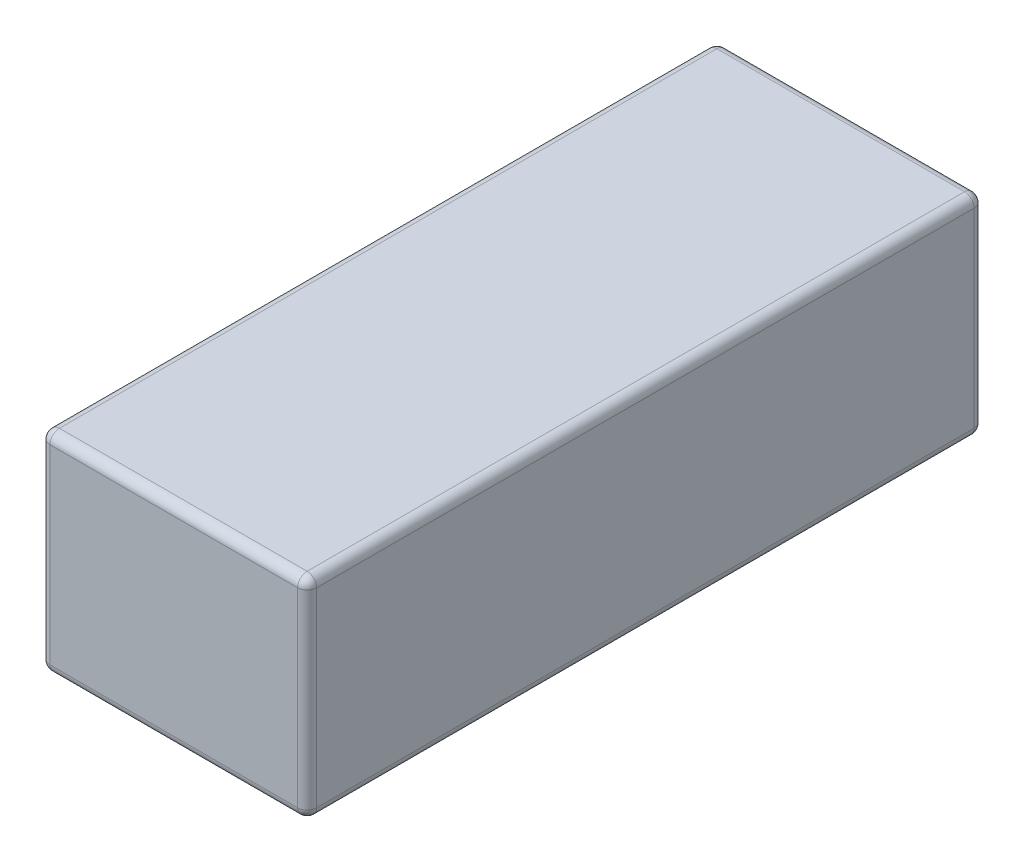
ISO-10303-21;
HEADER;
FILE_DESCRIPTION(('STEP AP214'),'2;1');
FILE_NAME('part.step','',(''),(''),'','','');
FILE_SCHEMA(('AUTOMOTIVE_DESIGN { 1 0 10303 214 1 1 1 1 }'));
ENDSEC;
DATA;
#1=APPLICATION_CONTEXT('core data for automotive mechanical design processes');
#2=APPLICATION_PROTOCOL_DEFINITION('international standard','automotive_design',2000,#1);
#3=PRODUCT_CONTEXT('',#1,'mechanical');
#4=PRODUCT('Part','Part','',(#3));
#5=PRODUCT_RELATED_PRODUCT_CATEGORY('part','',(#4));
#6=PRODUCT_DEFINITION_FORMATION('','',#4);
#7=PRODUCT_DEFINITION_CONTEXT('part definition',#1,'design');
#8=PRODUCT_DEFINITION('design','',#6,#7);
#9=PRODUCT_DEFINITION_SHAPE('','',#8);
#10=(LENGTH_UNIT() NAMED_UNIT(*) SI_UNIT(.MILLI.,.METRE.));
#11=(NAMED_UNIT(*) PLANE_ANGLE_UNIT() SI_UNIT($,.RADIAN.));
#12=(NAMED_UNIT(*) SI_UNIT($,.STERADIAN.) SOLID_ANGLE_UNIT());
#13=UNCERTAINTY_MEASURE_WITH_UNIT(LENGTH_MEASURE(1.E-05),#10,'distance_accuracy_value','');
#14=(GEOMETRIC_REPRESENTATION_CONTEXT(3) GLOBAL_UNCERTAINTY_ASSIGNED_CONTEXT((#13)) GLOBAL_UNIT_ASSIGNED_CONTEXT((#10,
#11,#12)) REPRESENTATION_CONTEXT('',''));
#15=CARTESIAN_POINT('',(0.,0.,0.));
#16=DIRECTION('',(0.,0.,1.));
#17=DIRECTION('',(1.,0.,0.));
#18=AXIS2_PLACEMENT_3D('',#15,#16,#17);
#19=CARTESIAN_POINT('',(28.,22.,142.));
#20=DIRECTION('',(-1.,0.,0.));
#21=DIRECTION('',(0.,-1.,0.));
#22=AXIS2_PLACEMENT_3D('',#19,#20,#21);
#23=PLANE('',#22);
#24=DIRECTION('',(0.,1.,0.));
#25=VECTOR('',#24,1.);
#26=CARTESIAN_POINT('',(28.,-22.,140.));
#27=LINE('',#26,#25);
#28=CARTESIAN_POINT('',(28.,20.,140.));
#29=VERTEX_POINT('',#28);
#30=CARTESIAN_POINT('',(28.,-20.,140.));
#31=VERTEX_POINT('',#30);
#32=EDGE_CURVE('E199',#29,#31,#27,.F.);
#33=ORIENTED_EDGE('',*,*,#32,.T.);
#34=DIRECTION('',(0.,0.,-1.));
#35=VECTOR('',#34,1.);
#36=CARTESIAN_POINT('',(28.,-20.,142.));
#37=LINE('',#36,#35);
#38=CARTESIAN_POINT('',(28.,-20.,2.));
#39=VERTEX_POINT('',#38);
#40=EDGE_CURVE('E201',#31,#39,#37,.T.);
#41=ORIENTED_EDGE('',*,*,#40,.T.);
#42=DIRECTION('',(0.,1.,0.));
#43=VECTOR('',#42,1.);
#44=CARTESIAN_POINT('',(28.,22.,2.));
#45=LINE('',#44,#43);
#46=CARTESIAN_POINT('',(28.,20.,2.));
#47=VERTEX_POINT('',#46);
#48=EDGE_CURVE('E197',#39,#47,#45,.T.);
#49=ORIENTED_EDGE('',*,*,#48,.T.);
#50=DIRECTION('',(0.,0.,-1.));
#51=VECTOR('',#50,1.);
#52=CARTESIAN_POINT('',(28.,20.,142.));
#53=LINE('',#52,#51);
#54=EDGE_CURVE('E195',#47,#29,#53,.F.);
#55=ORIENTED_EDGE('',*,*,#54,.T.);
#56=EDGE_LOOP('',(#33,#41,#49,#55));
#57=FACE_BOUND('',#56,.T.);
#58=ADVANCED_FACE('F39',(#57),#23,.F.);
#59=CARTESIAN_POINT('',(-28.,22.,142.));
#60=DIRECTION('',(0.,-1.,0.));
#61=DIRECTION('',(0.,0.,-1.));
#62=AXIS2_PLACEMENT_3D('',#59,#60,#61);
#63=PLANE('',#62);
#64=DIRECTION('',(-1.,0.,0.));
#65=VECTOR('',#64,1.);
#66=CARTESIAN_POINT('',(28.,22.,140.));
#67=LINE('',#66,#65);
#68=CARTESIAN_POINT('',(-26.,22.,140.));
#69=VERTEX_POINT('',#68);
#70=CARTESIAN_POINT('',(26.,22.,140.));
#71=VERTEX_POINT('',#70);
#72=EDGE_CURVE('E48',#69,#71,#67,.F.);
#73=ORIENTED_EDGE('',*,*,#72,.T.);
#74=DIRECTION('',(0.,0.,-1.));
#75=VECTOR('',#74,1.);
#76=CARTESIAN_POINT('',(26.,22.,142.));
#77=LINE('',#76,#75);
#78=CARTESIAN_POINT('',(26.,22.,2.));
#79=VERTEX_POINT('',#78);
#80=EDGE_CURVE('E11',#71,#79,#77,.T.);
#81=ORIENTED_EDGE('',*,*,#80,.T.);
#82=DIRECTION('',(-1.,0.,0.));
#83=VECTOR('',#82,1.);
#84=CARTESIAN_POINT('',(-28.,22.,2.));
#85=LINE('',#84,#83);
#86=CARTESIAN_POINT('',(-26.,22.,2.));
#87=VERTEX_POINT('',#86);
#88=EDGE_CURVE('E204',#79,#87,#85,.T.);
#89=ORIENTED_EDGE('',*,*,#88,.T.);
#90=DIRECTION('',(0.,0.,-1.));
#91=VECTOR('',#90,1.);
#92=CARTESIAN_POINT('',(-26.,22.,142.));
#93=LINE('',#92,#91);
#94=EDGE_CURVE('E59',#87,#69,#93,.F.);
#95=ORIENTED_EDGE('',*,*,#94,.T.);
#96=EDGE_LOOP('',(#73,#81,#89,#95));
#97=FACE_BOUND('',#96,.T.);
#98=ADVANCED_FACE('F298',(#97),#63,.F.);
#99=CARTESIAN_POINT('',(-28.,22.,142.));
#100=DIRECTION('',(1.,0.,0.));
#101=DIRECTION('',(0.,1.,0.));
#102=AXIS2_PLACEMENT_3D('',#99,#100,#101);
#103=PLANE('',#102);
#104=DIRECTION('',(0.,0.,-1.));
#105=VECTOR('',#104,1.);
#106=CARTESIAN_POINT('',(-28.,20.,142.));
#107=LINE('',#106,#105);
#108=CARTESIAN_POINT('',(-28.,20.,140.));
#109=VERTEX_POINT('',#108);
#110=CARTESIAN_POINT('',(-28.,20.,2.));
#111=VERTEX_POINT('',#110);
#112=EDGE_CURVE('E131',#109,#111,#107,.T.);
#113=ORIENTED_EDGE('',*,*,#112,.T.);
#114=DIRECTION('',(0.,-1.,0.));
#115=VECTOR('',#114,1.);
#116=CARTESIAN_POINT('',(-28.,22.,2.));
#117=LINE('',#116,#115);
#118=CARTESIAN_POINT('',(-28.,-20.,2.));
#119=VERTEX_POINT('',#118);
#120=EDGE_CURVE('E167',#111,#119,#117,.T.);
#121=ORIENTED_EDGE('',*,*,#120,.T.);
#122=DIRECTION('',(0.,0.,-1.));
#123=VECTOR('',#122,1.);
#124=CARTESIAN_POINT('',(-28.,-20.,142.));
#125=LINE('',#124,#123);
#126=CARTESIAN_POINT('',(-28.,-20.,140.));
#127=VERTEX_POINT('',#126);
#128=EDGE_CURVE('E134',#119,#127,#125,.F.);
#129=ORIENTED_EDGE('',*,*,#128,.T.);
#130=DIRECTION('',(0.,-1.,0.));
#131=VECTOR('',#130,1.);
#132=CARTESIAN_POINT('',(-28.,22.,140.));
#133=LINE('',#132,#131);
#134=EDGE_CURVE('E126',#127,#109,#133,.F.);
#135=ORIENTED_EDGE('',*,*,#134,.T.);
#136=EDGE_LOOP('',(#113,#121,#129,#135));
#137=FACE_BOUND('',#136,.T.);
#138=ADVANCED_FACE('F128',(#137),#103,.F.);
#139=CARTESIAN_POINT('',(-28.,-22.,142.));
#140=DIRECTION('',(0.,1.,0.));
#141=DIRECTION('',(0.,0.,1.));
#142=AXIS2_PLACEMENT_3D('',#139,#140,#141);
#143=PLANE('',#142);
#144=DIRECTION('',(1.,0.,0.));
#145=VECTOR('',#144,1.);
#146=CARTESIAN_POINT('',(-28.,-22.,140.));
#147=LINE('',#146,#145);
#148=CARTESIAN_POINT('',(26.,-22.,140.));
#149=VERTEX_POINT('',#148);
#150=CARTESIAN_POINT('',(-26.,-22.,140.));
#151=VERTEX_POINT('',#150);
#152=EDGE_CURVE('E180',#149,#151,#147,.F.);
#153=ORIENTED_EDGE('',*,*,#152,.T.);
#154=DIRECTION('',(0.,0.,-1.));
#155=VECTOR('',#154,1.);
#156=CARTESIAN_POINT('',(-26.,-22.,142.));
#157=LINE('',#156,#155);
#158=CARTESIAN_POINT('',(-26.,-22.,2.));
#159=VERTEX_POINT('',#158);
#160=EDGE_CURVE('E184',#151,#159,#157,.T.);
#161=ORIENTED_EDGE('',*,*,#160,.T.);
#162=DIRECTION('',(1.,0.,0.));
#163=VECTOR('',#162,1.);
#164=CARTESIAN_POINT('',(-28.,-22.,2.));
#165=LINE('',#164,#163);
#166=CARTESIAN_POINT('',(26.,-22.,2.));
#167=VERTEX_POINT('',#166);
#168=EDGE_CURVE('E182',#159,#167,#165,.T.);
#169=ORIENTED_EDGE('',*,*,#168,.T.);
#170=DIRECTION('',(0.,0.,-1.));
#171=VECTOR('',#170,1.);
#172=CARTESIAN_POINT('',(26.,-22.,142.));
#173=LINE('',#172,#171);
#174=EDGE_CURVE('E178',#167,#149,#173,.F.);
#175=ORIENTED_EDGE('',*,*,#174,.T.);
#176=EDGE_LOOP('',(#153,#161,#169,#175));
#177=FACE_BOUND('',#176,.T.);
#178=ADVANCED_FACE('F281',(#177),#143,.F.);
#179=CARTESIAN_POINT('',(0.,0.,142.));
#180=DIRECTION('',(0.,0.,1.));
#181=DIRECTION('',(1.,0.,0.));
#182=AXIS2_PLACEMENT_3D('',#179,#180,#181);
#183=PLANE('',#182);
#184=DIRECTION('',(0.,-1.,0.));
#185=VECTOR('',#184,1.);
#186=CARTESIAN_POINT('',(-26.,-22.,142.));
#187=LINE('',#186,#185);
#188=CARTESIAN_POINT('',(-26.,20.,142.));
#189=VERTEX_POINT('',#188);
#190=CARTESIAN_POINT('',(-26.,-20.,142.));
#191=VERTEX_POINT('',#190);
#192=EDGE_CURVE('E144',#189,#191,#187,.T.);
#193=ORIENTED_EDGE('',*,*,#192,.T.);
#194=DIRECTION('',(1.,0.,0.));
#195=VECTOR('',#194,1.);
#196=CARTESIAN_POINT('',(28.,-20.,142.));
#197=LINE('',#196,#195);
#198=CARTESIAN_POINT('',(26.,-20.,142.));
#199=VERTEX_POINT('',#198);
#200=EDGE_CURVE('E192',#191,#199,#197,.T.);
#201=ORIENTED_EDGE('',*,*,#200,.T.);
#202=DIRECTION('',(0.,1.,0.));
#203=VECTOR('',#202,1.);
#204=CARTESIAN_POINT('',(26.,22.,142.));
#205=LINE('',#204,#203);
#206=CARTESIAN_POINT('',(26.,20.,142.));
#207=VERTEX_POINT('',#206);
#208=EDGE_CURVE('E189',#199,#207,#205,.T.);
#209=ORIENTED_EDGE('',*,*,#208,.T.);
#210=DIRECTION('',(-1.,0.,0.));
#211=VECTOR('',#210,1.);
#212=CARTESIAN_POINT('',(-28.,20.,142.));
#213=LINE('',#212,#211);
#214=EDGE_CURVE('E187',#207,#189,#213,.T.);
#215=ORIENTED_EDGE('',*,*,#214,.T.);
#216=EDGE_LOOP('',(#193,#201,#209,#215));
#217=FACE_BOUND('',#216,.T.);
#218=ADVANCED_FACE('F268',(#217),#183,.T.);
#219=CARTESIAN_POINT('',(0.,0.,0.));
#220=DIRECTION('',(0.,0.,1.));
#221=DIRECTION('',(1.,0.,0.));
#222=AXIS2_PLACEMENT_3D('',#219,#220,#221);
#223=PLANE('',#222);
#224=DIRECTION('',(1.,0.,0.));
#225=VECTOR('',#224,1.);
#226=CARTESIAN_POINT('',(0.,-20.,0.));
#227=LINE('',#226,#225);
#228=CARTESIAN_POINT('',(26.,-20.,0.));
#229=VERTEX_POINT('',#228);
#230=CARTESIAN_POINT('',(-26.,-20.,0.));
#231=VERTEX_POINT('',#230);
#232=EDGE_CURVE('E173',#229,#231,#227,.F.);
#233=ORIENTED_EDGE('',*,*,#232,.T.);
#234=DIRECTION('',(0.,-1.,0.));
#235=VECTOR('',#234,1.);
#236=CARTESIAN_POINT('',(-26.,0.,0.));
#237=LINE('',#236,#235);
#238=CARTESIAN_POINT('',(-26.,20.,0.));
#239=VERTEX_POINT('',#238);
#240=EDGE_CURVE('E175',#231,#239,#237,.F.);
#241=ORIENTED_EDGE('',*,*,#240,.T.);
#242=DIRECTION('',(-1.,0.,0.));
#243=VECTOR('',#242,1.);
#244=CARTESIAN_POINT('',(0.,20.,0.));
#245=LINE('',#244,#243);
#246=CARTESIAN_POINT('',(26.,20.,0.));
#247=VERTEX_POINT('',#246);
#248=EDGE_CURVE('E169',#239,#247,#245,.F.);
#249=ORIENTED_EDGE('',*,*,#248,.T.);
#250=DIRECTION('',(0.,1.,0.));
#251=VECTOR('',#250,1.);
#252=CARTESIAN_POINT('',(26.,0.,0.));
#253=LINE('',#252,#251);
#254=EDGE_CURVE('E171',#247,#229,#253,.F.);
#255=ORIENTED_EDGE('',*,*,#254,.T.);
#256=EDGE_LOOP('',(#233,#241,#249,#255));
#257=FACE_BOUND('',#256,.T.);
#258=ADVANCED_FACE('F484',(#257),#223,.F.);
#259=CARTESIAN_POINT('',(26.,0.,140.));
#260=DIRECTION('',(0.,-1.,0.));
#261=DIRECTION('',(1.,0.,0.));
#262=AXIS2_PLACEMENT_3D('',#259,#260,#261);
#263=CYLINDRICAL_SURFACE('',#262,2.);
#264=CARTESIAN_POINT('',(26.,20.,140.));
#265=DIRECTION('',(0.,1.,0.));
#266=DIRECTION('',(0.,0.,1.));
#267=AXIS2_PLACEMENT_3D('',#264,#265,#266);
#268=CIRCLE('',#267,2.);
#269=EDGE_CURVE('E43',#207,#29,#268,.T.);
#270=ORIENTED_EDGE('',*,*,#269,.F.);
#271=ORIENTED_EDGE('',*,*,#208,.F.);
#272=CARTESIAN_POINT('',(26.,-20.,140.));
#273=DIRECTION('',(0.,-1.,0.));
#274=DIRECTION('',(0.,0.,-1.));
#275=AXIS2_PLACEMENT_3D('',#272,#273,#274);
#276=CIRCLE('',#275,2.);
#277=EDGE_CURVE('E164',#31,#199,#276,.T.);
#278=ORIENTED_EDGE('',*,*,#277,.F.);
#279=ORIENTED_EDGE('',*,*,#32,.F.);
#280=EDGE_LOOP('',(#270,#271,#278,#279));
#281=FACE_BOUND('',#280,.T.);
#282=ADVANCED_FACE('F41',(#281),#263,.T.);
#283=CARTESIAN_POINT('',(26.,20.,140.));
#284=DIRECTION('',(1.,0.,0.));
#285=DIRECTION('',(0.,0.,-1.));
#286=AXIS2_PLACEMENT_3D('',#283,#284,#285);
#287=SPHERICAL_SURFACE('',#286,2.);
#288=CARTESIAN_POINT('',(26.,20.,140.));
#289=DIRECTION('',(1.,0.,0.));
#290=DIRECTION('',(0.,0.,-1.));
#291=AXIS2_PLACEMENT_3D('',#288,#289,#290);
#292=CIRCLE('',#291,2.);
#293=EDGE_CURVE('E249',#207,#71,#292,.F.);
#294=ORIENTED_EDGE('',*,*,#293,.F.);
#295=ORIENTED_EDGE('',*,*,#269,.T.);
#296=CARTESIAN_POINT('',(26.,20.,140.));
#297=DIRECTION('',(0.,0.,1.));
#298=DIRECTION('',(1.,0.,0.));
#299=AXIS2_PLACEMENT_3D('',#296,#297,#298);
#300=CIRCLE('',#299,2.);
#301=EDGE_CURVE('E251',#71,#29,#300,.F.);
#302=ORIENTED_EDGE('',*,*,#301,.F.);
#303=EDGE_LOOP('',(#294,#295,#302));
#304=FACE_BOUND('',#303,.T.);
#305=ADVANCED_FACE('F291',(#304),#287,.T.);
#306=CARTESIAN_POINT('',(26.,-20.,140.));
#307=DIRECTION('',(0.,0.,1.));
#308=DIRECTION('',(1.,0.,0.));
#309=AXIS2_PLACEMENT_3D('',#306,#307,#308);
#310=SPHERICAL_SURFACE('',#309,2.);
#311=CARTESIAN_POINT('',(26.,-20.,140.));
#312=DIRECTION('',(0.,0.,1.));
#313=DIRECTION('',(1.,0.,0.));
#314=AXIS2_PLACEMENT_3D('',#311,#312,#313);
#315=CIRCLE('',#314,2.);
#316=EDGE_CURVE('E244',#31,#149,#315,.F.);
#317=ORIENTED_EDGE('',*,*,#316,.F.);
#318=ORIENTED_EDGE('',*,*,#277,.T.);
#319=CARTESIAN_POINT('',(26.,-20.,140.));
#320=DIRECTION('',(1.,0.,0.));
#321=DIRECTION('',(0.,0.,-1.));
#322=AXIS2_PLACEMENT_3D('',#319,#320,#321);
#323=CIRCLE('',#322,2.);
#324=EDGE_CURVE('E247',#149,#199,#323,.F.);
#325=ORIENTED_EDGE('',*,*,#324,.F.);
#326=EDGE_LOOP('',(#317,#318,#325));
#327=FACE_BOUND('',#326,.T.);
#328=ADVANCED_FACE('F259',(#327),#310,.T.);
#329=CARTESIAN_POINT('',(26.,20.,142.));
#330=DIRECTION('',(0.,0.,-1.));
#331=DIRECTION('',(-1.,0.,0.));
#332=AXIS2_PLACEMENT_3D('',#329,#330,#331);
#333=CYLINDRICAL_SURFACE('',#332,2.);
#334=ORIENTED_EDGE('',*,*,#301,.T.);
#335=ORIENTED_EDGE('',*,*,#54,.F.);
#336=CARTESIAN_POINT('',(26.,20.,2.));
#337=DIRECTION('',(0.,0.,-1.));
#338=DIRECTION('',(-1.,0.,0.));
#339=AXIS2_PLACEMENT_3D('',#336,#337,#338);
#340=CIRCLE('',#339,2.);
#341=EDGE_CURVE('E238',#79,#47,#340,.T.);
#342=ORIENTED_EDGE('',*,*,#341,.F.);
#343=ORIENTED_EDGE('',*,*,#80,.F.);
#344=EDGE_LOOP('',(#334,#335,#342,#343));
#345=FACE_BOUND('',#344,.T.);
#346=ADVANCED_FACE('F295',(#345),#333,.T.);
#347=CARTESIAN_POINT('',(0.,20.,140.));
#348=DIRECTION('',(1.,0.,0.));
#349=DIRECTION('',(0.,0.,-1.));
#350=AXIS2_PLACEMENT_3D('',#347,#348,#349);
#351=CYLINDRICAL_SURFACE('',#350,2.);
#352=ORIENTED_EDGE('',*,*,#293,.T.);
#353=ORIENTED_EDGE('',*,*,#72,.F.);
#354=CARTESIAN_POINT('',(-26.,20.,140.));
#355=DIRECTION('',(-1.,0.,0.));
#356=DIRECTION('',(0.,0.,1.));
#357=AXIS2_PLACEMENT_3D('',#354,#355,#356);
#358=CIRCLE('',#357,2.);
#359=EDGE_CURVE('E148',#189,#69,#358,.T.);
#360=ORIENTED_EDGE('',*,*,#359,.F.);
#361=ORIENTED_EDGE('',*,*,#214,.F.);
#362=EDGE_LOOP('',(#352,#353,#360,#361));
#363=FACE_BOUND('',#362,.T.);
#364=ADVANCED_FACE('F448',(#363),#351,.T.);
#365=CARTESIAN_POINT('',(-26.,0.,140.));
#366=DIRECTION('',(0.,1.,0.));
#367=DIRECTION('',(-1.,0.,0.));
#368=AXIS2_PLACEMENT_3D('',#365,#366,#367);
#369=CYLINDRICAL_SURFACE('',#368,2.);
#370=CARTESIAN_POINT('',(-26.,-20.,140.));
#371=DIRECTION('',(0.,-1.,0.));
#372=DIRECTION('',(0.,0.,-1.));
#373=AXIS2_PLACEMENT_3D('',#370,#371,#372);
#374=CIRCLE('',#373,2.);
#375=EDGE_CURVE('E149',#191,#127,#374,.T.);
#376=ORIENTED_EDGE('',*,*,#375,.F.);
#377=ORIENTED_EDGE('',*,*,#192,.F.);
#378=CARTESIAN_POINT('',(-26.,20.,140.));
#379=DIRECTION('',(0.,1.,0.));
#380=DIRECTION('',(0.,0.,1.));
#381=AXIS2_PLACEMENT_3D('',#378,#379,#380);
#382=CIRCLE('',#381,2.);
#383=EDGE_CURVE('E141',#109,#189,#382,.T.);
#384=ORIENTED_EDGE('',*,*,#383,.F.);
#385=ORIENTED_EDGE('',*,*,#134,.F.);
#386=EDGE_LOOP('',(#376,#377,#384,#385));
#387=FACE_BOUND('',#386,.T.);
#388=ADVANCED_FACE('F143',(#387),#369,.T.);
#389=CARTESIAN_POINT('',(0.,-20.,140.));
#390=DIRECTION('',(-1.,0.,0.));
#391=DIRECTION('',(0.,0.,1.));
#392=AXIS2_PLACEMENT_3D('',#389,#390,#391);
#393=CYLINDRICAL_SURFACE('',#392,2.);
#394=ORIENTED_EDGE('',*,*,#324,.T.);
#395=ORIENTED_EDGE('',*,*,#200,.F.);
#396=CARTESIAN_POINT('',(-26.,-20.,140.));
#397=DIRECTION('',(-1.,0.,0.));
#398=DIRECTION('',(0.,0.,1.));
#399=AXIS2_PLACEMENT_3D('',#396,#397,#398);
#400=CIRCLE('',#399,2.);
#401=EDGE_CURVE('E233',#151,#191,#400,.T.);
#402=ORIENTED_EDGE('',*,*,#401,.F.);
#403=ORIENTED_EDGE('',*,*,#152,.F.);
#404=EDGE_LOOP('',(#394,#395,#402,#403));
#405=FACE_BOUND('',#404,.T.);
#406=ADVANCED_FACE('F271',(#405),#393,.T.);
#407=CARTESIAN_POINT('',(26.,-20.,142.));
#408=DIRECTION('',(0.,0.,-1.));
#409=DIRECTION('',(-1.,0.,0.));
#410=AXIS2_PLACEMENT_3D('',#407,#408,#409);
#411=CYLINDRICAL_SURFACE('',#410,2.);
#412=ORIENTED_EDGE('',*,*,#316,.T.);
#413=ORIENTED_EDGE('',*,*,#174,.F.);
#414=CARTESIAN_POINT('',(26.,-20.,2.));
#415=DIRECTION('',(0.,0.,-1.));
#416=DIRECTION('',(-1.,0.,0.));
#417=AXIS2_PLACEMENT_3D('',#414,#415,#416);
#418=CIRCLE('',#417,2.);
#419=EDGE_CURVE('E230',#39,#167,#418,.T.);
#420=ORIENTED_EDGE('',*,*,#419,.F.);
#421=ORIENTED_EDGE('',*,*,#40,.F.);
#422=EDGE_LOOP('',(#412,#413,#420,#421));
#423=FACE_BOUND('',#422,.T.);
#424=ADVANCED_FACE('F285',(#423),#411,.T.);
#425=CARTESIAN_POINT('',(26.,22.,2.));
#426=DIRECTION('',(0.,1.,0.));
#427=DIRECTION('',(-1.,0.,0.));
#428=AXIS2_PLACEMENT_3D('',#425,#426,#427);
#429=CYLINDRICAL_SURFACE('',#428,2.);
#430=CARTESIAN_POINT('',(26.,20.,2.));
#431=DIRECTION('',(0.,1.,0.));
#432=DIRECTION('',(0.,0.,1.));
#433=AXIS2_PLACEMENT_3D('',#430,#431,#432);
#434=CIRCLE('',#433,2.);
#435=EDGE_CURVE('E241',#47,#247,#434,.T.);
#436=ORIENTED_EDGE('',*,*,#435,.F.);
#437=ORIENTED_EDGE('',*,*,#48,.F.);
#438=CARTESIAN_POINT('',(26.,-20.,2.));
#439=DIRECTION('',(0.,-1.,0.));
#440=DIRECTION('',(0.,0.,-1.));
#441=AXIS2_PLACEMENT_3D('',#438,#439,#440);
#442=CIRCLE('',#441,2.);
#443=EDGE_CURVE('E228',#229,#39,#442,.T.);
#444=ORIENTED_EDGE('',*,*,#443,.F.);
#445=ORIENTED_EDGE('',*,*,#254,.F.);
#446=EDGE_LOOP('',(#436,#437,#444,#445));
#447=FACE_BOUND('',#446,.T.);
#448=ADVANCED_FACE('F323',(#447),#429,.T.);
#449=CARTESIAN_POINT('',(26.,20.,2.));
#450=DIRECTION('',(1.,0.,0.));
#451=DIRECTION('',(0.,0.,-1.));
#452=AXIS2_PLACEMENT_3D('',#449,#450,#451);
#453=SPHERICAL_SURFACE('',#452,2.);
#454=ORIENTED_EDGE('',*,*,#341,.T.);
#455=ORIENTED_EDGE('',*,*,#435,.T.);
#456=CARTESIAN_POINT('',(26.,20.,2.));
#457=DIRECTION('',(1.,0.,0.));
#458=DIRECTION('',(0.,1.,0.));
#459=AXIS2_PLACEMENT_3D('',#456,#457,#458);
#460=CIRCLE('',#459,2.);
#461=EDGE_CURVE('E155',#79,#247,#460,.F.);
#462=ORIENTED_EDGE('',*,*,#461,.F.);
#463=EDGE_LOOP('',(#454,#455,#462));
#464=FACE_BOUND('',#463,.T.);
#465=ADVANCED_FACE('F325',(#464),#453,.T.);
#466=CARTESIAN_POINT('',(-26.,20.,140.));
#467=DIRECTION('',(0.,0.,1.));
#468=DIRECTION('',(1.,0.,0.));
#469=AXIS2_PLACEMENT_3D('',#466,#467,#468);
#470=SPHERICAL_SURFACE('',#469,2.);
#471=ORIENTED_EDGE('',*,*,#383,.T.);
#472=ORIENTED_EDGE('',*,*,#359,.T.);
#473=CARTESIAN_POINT('',(-26.,20.,140.));
#474=DIRECTION('',(0.,0.,1.));
#475=DIRECTION('',(1.,0.,0.));
#476=AXIS2_PLACEMENT_3D('',#473,#474,#475);
#477=CIRCLE('',#476,2.);
#478=EDGE_CURVE('E152',#109,#69,#477,.F.);
#479=ORIENTED_EDGE('',*,*,#478,.F.);
#480=EDGE_LOOP('',(#471,#472,#479));
#481=FACE_BOUND('',#480,.T.);
#482=ADVANCED_FACE('F153',(#481),#470,.T.);
#483=CARTESIAN_POINT('',(-26.,-20.,140.));
#484=DIRECTION('',(0.,0.,1.));
#485=DIRECTION('',(1.,0.,0.));
#486=AXIS2_PLACEMENT_3D('',#483,#484,#485);
#487=SPHERICAL_SURFACE('',#486,2.);
#488=ORIENTED_EDGE('',*,*,#401,.T.);
#489=ORIENTED_EDGE('',*,*,#375,.T.);
#490=CARTESIAN_POINT('',(-26.,-20.,140.));
#491=DIRECTION('',(0.,0.,1.));
#492=DIRECTION('',(1.,0.,0.));
#493=AXIS2_PLACEMENT_3D('',#490,#491,#492);
#494=CIRCLE('',#493,2.);
#495=EDGE_CURVE('E156',#151,#127,#494,.F.);
#496=ORIENTED_EDGE('',*,*,#495,.F.);
#497=EDGE_LOOP('',(#488,#489,#496));
#498=FACE_BOUND('',#497,.T.);
#499=ADVANCED_FACE('F274',(#498),#487,.T.);
#500=CARTESIAN_POINT('',(26.,-20.,2.));
#501=DIRECTION('',(1.,0.,0.));
#502=DIRECTION('',(0.,0.,-1.));
#503=AXIS2_PLACEMENT_3D('',#500,#501,#502);
#504=SPHERICAL_SURFACE('',#503,2.);
#505=ORIENTED_EDGE('',*,*,#443,.T.);
#506=ORIENTED_EDGE('',*,*,#419,.T.);
#507=CARTESIAN_POINT('',(26.,-20.,2.));
#508=DIRECTION('',(1.,0.,0.));
#509=DIRECTION('',(0.,0.,-1.));
#510=AXIS2_PLACEMENT_3D('',#507,#508,#509);
#511=CIRCLE('',#510,2.);
#512=EDGE_CURVE('E221',#229,#167,#511,.F.);
#513=ORIENTED_EDGE('',*,*,#512,.F.);
#514=EDGE_LOOP('',(#505,#506,#513));
#515=FACE_BOUND('',#514,.T.);
#516=ADVANCED_FACE('F319',(#515),#504,.T.);
#517=CARTESIAN_POINT('',(-28.,20.,2.));
#518=DIRECTION('',(-1.,0.,0.));
#519=DIRECTION('',(0.,0.,1.));
#520=AXIS2_PLACEMENT_3D('',#517,#518,#519);
#521=CYLINDRICAL_SURFACE('',#520,2.);
#522=ORIENTED_EDGE('',*,*,#461,.T.);
#523=ORIENTED_EDGE('',*,*,#248,.F.);
#524=CARTESIAN_POINT('',(-26.,20.,2.));
#525=DIRECTION('',(-1.,0.,0.));
#526=DIRECTION('',(0.,0.,1.));
#527=AXIS2_PLACEMENT_3D('',#524,#525,#526);
#528=CIRCLE('',#527,2.);
#529=EDGE_CURVE('E218',#87,#239,#528,.T.);
#530=ORIENTED_EDGE('',*,*,#529,.F.);
#531=ORIENTED_EDGE('',*,*,#88,.F.);
#532=EDGE_LOOP('',(#522,#523,#530,#531));
#533=FACE_BOUND('',#532,.T.);
#534=ADVANCED_FACE('F303',(#533),#521,.T.);
#535=CARTESIAN_POINT('',(-26.,20.,142.));
#536=DIRECTION('',(0.,0.,-1.));
#537=DIRECTION('',(-1.,0.,0.));
#538=AXIS2_PLACEMENT_3D('',#535,#536,#537);
#539=CYLINDRICAL_SURFACE('',#538,2.);
#540=ORIENTED_EDGE('',*,*,#478,.T.);
#541=ORIENTED_EDGE('',*,*,#94,.F.);
#542=CARTESIAN_POINT('',(-26.,20.,2.));
#543=DIRECTION('',(0.,0.,-1.));
#544=DIRECTION('',(-1.,0.,0.));
#545=AXIS2_PLACEMENT_3D('',#542,#543,#544);
#546=CIRCLE('',#545,2.);
#547=EDGE_CURVE('E160',#111,#87,#546,.T.);
#548=ORIENTED_EDGE('',*,*,#547,.F.);
#549=ORIENTED_EDGE('',*,*,#112,.F.);
#550=EDGE_LOOP('',(#540,#541,#548,#549));
#551=FACE_BOUND('',#550,.T.);
#552=ADVANCED_FACE('F158',(#551),#539,.T.);
#553=CARTESIAN_POINT('',(-26.,-20.,142.));
#554=DIRECTION('',(0.,0.,-1.));
#555=DIRECTION('',(-1.,0.,0.));
#556=AXIS2_PLACEMENT_3D('',#553,#554,#555);
#557=CYLINDRICAL_SURFACE('',#556,2.);
#558=ORIENTED_EDGE('',*,*,#495,.T.);
#559=ORIENTED_EDGE('',*,*,#128,.F.);
#560=CARTESIAN_POINT('',(-26.,-20.,2.));
#561=DIRECTION('',(0.,0.,-1.));
#562=DIRECTION('',(-1.,0.,0.));
#563=AXIS2_PLACEMENT_3D('',#560,#561,#562);
#564=CIRCLE('',#563,2.);
#565=EDGE_CURVE('E214',#159,#119,#564,.T.);
#566=ORIENTED_EDGE('',*,*,#565,.F.);
#567=ORIENTED_EDGE('',*,*,#160,.F.);
#568=EDGE_LOOP('',(#558,#559,#566,#567));
#569=FACE_BOUND('',#568,.T.);
#570=ADVANCED_FACE('F278',(#569),#557,.T.);
#571=CARTESIAN_POINT('',(-28.,-20.,2.));
#572=DIRECTION('',(1.,0.,0.));
#573=DIRECTION('',(0.,0.,-1.));
#574=AXIS2_PLACEMENT_3D('',#571,#572,#573);
#575=CYLINDRICAL_SURFACE('',#574,2.);
#576=ORIENTED_EDGE('',*,*,#512,.T.);
#577=ORIENTED_EDGE('',*,*,#168,.F.);
#578=CARTESIAN_POINT('',(-26.,-20.,2.));
#579=DIRECTION('',(-1.,0.,0.));
#580=DIRECTION('',(0.,0.,1.));
#581=AXIS2_PLACEMENT_3D('',#578,#579,#580);
#582=CIRCLE('',#581,2.);
#583=EDGE_CURVE('E212',#231,#159,#582,.T.);
#584=ORIENTED_EDGE('',*,*,#583,.F.);
#585=ORIENTED_EDGE('',*,*,#232,.F.);
#586=EDGE_LOOP('',(#576,#577,#584,#585));
#587=FACE_BOUND('',#586,.T.);
#588=ADVANCED_FACE('F316',(#587),#575,.T.);
#589=CARTESIAN_POINT('',(-26.,20.,2.));
#590=DIRECTION('',(0.,1.,0.));
#591=DIRECTION('',(0.,0.,1.));
#592=AXIS2_PLACEMENT_3D('',#589,#590,#591);
#593=SPHERICAL_SURFACE('',#592,2.);
#594=ORIENTED_EDGE('',*,*,#547,.T.);
#595=ORIENTED_EDGE('',*,*,#529,.T.);
#596=CARTESIAN_POINT('',(-26.,20.,2.));
#597=DIRECTION('',(0.,1.,0.));
#598=DIRECTION('',(0.,0.,1.));
#599=AXIS2_PLACEMENT_3D('',#596,#597,#598);
#600=CIRCLE('',#599,2.);
#601=EDGE_CURVE('E210',#111,#239,#600,.F.);
#602=ORIENTED_EDGE('',*,*,#601,.F.);
#603=EDGE_LOOP('',(#594,#595,#602));
#604=FACE_BOUND('',#603,.T.);
#605=ADVANCED_FACE('F305',(#604),#593,.T.);
#606=CARTESIAN_POINT('',(-26.,-20.,2.));
#607=DIRECTION('',(0.,-1.,0.));
#608=DIRECTION('',(0.,0.,-1.));
#609=AXIS2_PLACEMENT_3D('',#606,#607,#608);
#610=SPHERICAL_SURFACE('',#609,2.);
#611=ORIENTED_EDGE('',*,*,#583,.T.);
#612=ORIENTED_EDGE('',*,*,#565,.T.);
#613=CARTESIAN_POINT('',(-26.,-20.,2.));
#614=DIRECTION('',(0.,-1.,0.));
#615=DIRECTION('',(0.,0.,-1.));
#616=AXIS2_PLACEMENT_3D('',#613,#614,#615);
#617=CIRCLE('',#616,2.);
#618=EDGE_CURVE('E208',#231,#119,#617,.F.);
#619=ORIENTED_EDGE('',*,*,#618,.F.);
#620=EDGE_LOOP('',(#611,#612,#619));
#621=FACE_BOUND('',#620,.T.);
#622=ADVANCED_FACE('F312',(#621),#610,.T.);
#623=CARTESIAN_POINT('',(-26.,22.,2.));
#624=DIRECTION('',(0.,-1.,0.));
#625=DIRECTION('',(1.,0.,0.));
#626=AXIS2_PLACEMENT_3D('',#623,#624,#625);
#627=CYLINDRICAL_SURFACE('',#626,2.);
#628=ORIENTED_EDGE('',*,*,#601,.T.);
#629=ORIENTED_EDGE('',*,*,#240,.F.);
#630=ORIENTED_EDGE('',*,*,#618,.T.);
#631=ORIENTED_EDGE('',*,*,#120,.F.);
#632=EDGE_LOOP('',(#628,#629,#630,#631));
#633=FACE_BOUND('',#632,.T.);
#634=ADVANCED_FACE('F309',(#633),#627,.T.);
#635=CLOSED_SHELL('',(#58,#98,#138,#178,#218,#258,#282,#305,#328,#346,#364,#388,#406,#424,#448,
#465,#482,#499,#516,#534,#552,#570,#588,#605,#622,#634));
#636=MANIFOLD_SOLID_BREP('B2',#635);
#637=ADVANCED_BREP_SHAPE_REPRESENTATION('',(#18,#636),#14);
#638=SHAPE_DEFINITION_REPRESENTATION(#9,#637);
ENDSEC;
END-ISO-10303-21;
